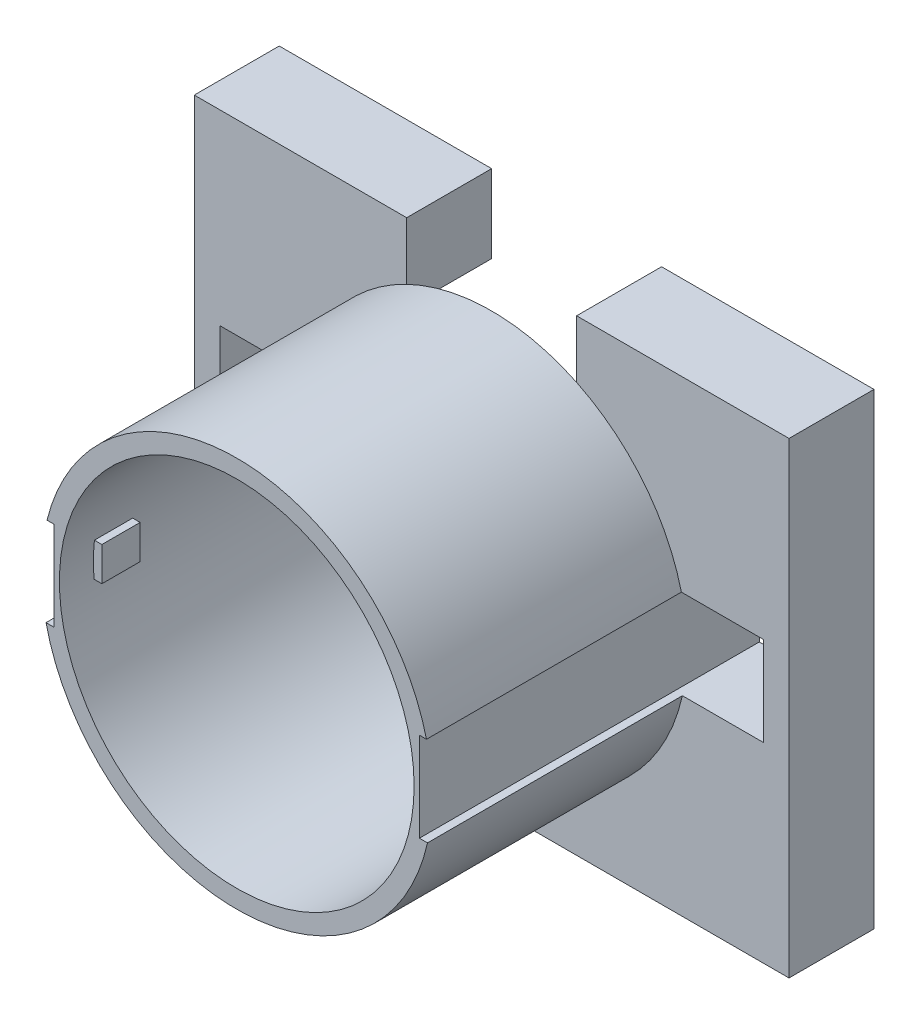
ISO-10303-21;
HEADER;
FILE_DESCRIPTION(('STEP AP214'),'2;1');
FILE_NAME('part.step','',(''),(''),'','','');
FILE_SCHEMA(('AUTOMOTIVE_DESIGN { 1 0 10303 214 1 1 1 1 }'));
ENDSEC;
DATA;
#1=APPLICATION_CONTEXT('core data for automotive mechanical design processes');
#2=APPLICATION_PROTOCOL_DEFINITION('international standard','automotive_design',2000,#1);
#3=PRODUCT_CONTEXT('',#1,'mechanical');
#4=PRODUCT('Part','Part','',(#3));
#5=PRODUCT_RELATED_PRODUCT_CATEGORY('part','',(#4));
#6=PRODUCT_DEFINITION_FORMATION('','',#4);
#7=PRODUCT_DEFINITION_CONTEXT('part definition',#1,'design');
#8=PRODUCT_DEFINITION('design','',#6,#7);
#9=PRODUCT_DEFINITION_SHAPE('','',#8);
#10=(LENGTH_UNIT() NAMED_UNIT(*) SI_UNIT(.MILLI.,.METRE.));
#11=(NAMED_UNIT(*) PLANE_ANGLE_UNIT() SI_UNIT($,.RADIAN.));
#12=(NAMED_UNIT(*) SI_UNIT($,.STERADIAN.) SOLID_ANGLE_UNIT());
#13=UNCERTAINTY_MEASURE_WITH_UNIT(LENGTH_MEASURE(1.E-05),#10,'distance_accuracy_value','');
#14=(GEOMETRIC_REPRESENTATION_CONTEXT(3) GLOBAL_UNCERTAINTY_ASSIGNED_CONTEXT((#13)) GLOBAL_UNIT_ASSIGNED_CONTEXT((#10,
#11,#12)) REPRESENTATION_CONTEXT('',''));
#15=CARTESIAN_POINT('',(0.,0.,0.));
#16=DIRECTION('',(0.,0.,1.));
#17=DIRECTION('',(1.,0.,0.));
#18=AXIS2_PLACEMENT_3D('',#15,#16,#17);
#19=CARTESIAN_POINT('',(0.,55.,20.));
#20=DIRECTION('',(0.,1.,0.));
#21=DIRECTION('',(-1.,0.,0.));
#22=AXIS2_PLACEMENT_3D('',#19,#20,#21);
#23=PLANE('',#22);
#24=DIRECTION('',(0.,0.,-1.));
#25=VECTOR('',#24,1.);
#26=CARTESIAN_POINT('',(20.,55.,20.));
#27=LINE('',#26,#25);
#28=CARTESIAN_POINT('',(20.,55.,20.));
#29=VERTEX_POINT('',#28);
#30=CARTESIAN_POINT('',(20.,55.,0.));
#31=VERTEX_POINT('',#30);
#32=EDGE_CURVE('E255',#29,#31,#27,.T.);
#33=ORIENTED_EDGE('',*,*,#32,.F.);
#34=DIRECTION('',(1.,0.,0.));
#35=VECTOR('',#34,1.);
#36=CARTESIAN_POINT('',(0.,55.,20.));
#37=LINE('',#36,#35);
#38=CARTESIAN_POINT('',(70.,55.,20.));
#39=VERTEX_POINT('',#38);
#40=EDGE_CURVE('E511',#29,#39,#37,.T.);
#41=ORIENTED_EDGE('',*,*,#40,.T.);
#42=DIRECTION('',(0.,0.,-1.));
#43=VECTOR('',#42,1.);
#44=CARTESIAN_POINT('',(70.,55.,20.));
#45=LINE('',#44,#43);
#46=CARTESIAN_POINT('',(70.,55.,0.));
#47=VERTEX_POINT('',#46);
#48=EDGE_CURVE('E297',#39,#47,#45,.T.);
#49=ORIENTED_EDGE('',*,*,#48,.T.);
#50=DIRECTION('',(1.,0.,0.));
#51=VECTOR('',#50,1.);
#52=CARTESIAN_POINT('',(0.,55.,0.));
#53=LINE('',#52,#51);
#54=EDGE_CURVE('E267',#31,#47,#53,.T.);
#55=ORIENTED_EDGE('',*,*,#54,.F.);
#56=EDGE_LOOP('',(#33,#41,#49,#55));
#57=FACE_BOUND('',#56,.T.);
#58=ADVANCED_FACE('F41',(#57),#23,.T.);
#59=CARTESIAN_POINT('',(0.,0.,20.));
#60=DIRECTION('',(0.,0.,-1.));
#61=DIRECTION('',(-1.,0.,0.));
#62=AXIS2_PLACEMENT_3D('',#59,#60,#61);
#63=CYLINDRICAL_SURFACE('',#62,41.75);
#64=DIRECTION('',(0.,0.,-1.));
#65=VECTOR('',#64,1.);
#66=CARTESIAN_POINT('',(20.,36.6478171246256,20.));
#67=LINE('',#66,#65);
#68=CARTESIAN_POINT('',(20.,36.6478171246256,20.));
#69=VERTEX_POINT('',#68);
#70=CARTESIAN_POINT('',(20.,36.6478171246256,0.));
#71=VERTEX_POINT('',#70);
#72=EDGE_CURVE('E259',#69,#71,#67,.T.);
#73=ORIENTED_EDGE('',*,*,#72,.T.);
#74=CARTESIAN_POINT('',(0.,0.,0.));
#75=DIRECTION('',(0.,0.,1.));
#76=DIRECTION('',(1.,0.,0.));
#77=AXIS2_PLACEMENT_3D('',#74,#75,#76);
#78=CIRCLE('',#77,41.75);
#79=CARTESIAN_POINT('',(-20.,36.6478171246256,0.));
#80=VERTEX_POINT('',#79);
#81=EDGE_CURVE('E250',#80,#71,#78,.T.);
#82=ORIENTED_EDGE('',*,*,#81,.F.);
#83=DIRECTION('',(0.,0.,-1.));
#84=VECTOR('',#83,1.);
#85=CARTESIAN_POINT('',(-20.,36.6478171246256,20.));
#86=LINE('',#85,#84);
#87=CARTESIAN_POINT('',(-20.,36.6478171246256,20.));
#88=VERTEX_POINT('',#87);
#89=EDGE_CURVE('E233',#80,#88,#86,.F.);
#90=ORIENTED_EDGE('',*,*,#89,.T.);
#91=CARTESIAN_POINT('',(0.,0.,20.));
#92=DIRECTION('',(0.,0.,1.));
#93=DIRECTION('',(1.,0.,0.));
#94=AXIS2_PLACEMENT_3D('',#91,#92,#93);
#95=CIRCLE('',#94,41.75);
#96=EDGE_CURVE('E542',#88,#69,#95,.F.);
#97=ORIENTED_EDGE('',*,*,#96,.T.);
#98=EDGE_LOOP('',(#73,#82,#90,#97));
#99=FACE_BOUND('',#98,.T.);
#100=CARTESIAN_POINT('',(0.,0.,80.));
#101=DIRECTION('',(0.,0.,1.));
#102=DIRECTION('',(1.,0.,0.));
#103=AXIS2_PLACEMENT_3D('',#100,#101,#102);
#104=CIRCLE('',#103,41.75);
#105=CARTESIAN_POINT('',(41.75,0.,80.));
#106=VERTEX_POINT('',#105);
#107=EDGE_CURVE('E497',#106,#106,#104,.T.);
#108=ORIENTED_EDGE('',*,*,#107,.T.);
#109=EDGE_LOOP('',(#108));
#110=FACE_BOUND('',#109,.T.);
#111=DIRECTION('',(0.,0.,-1.));
#112=VECTOR('',#111,1.);
#113=CARTESIAN_POINT('',(-41.5067765551602,4.50000000000001,20.));
#114=LINE('',#113,#112);
#115=CARTESIAN_POINT('',(-41.5067765551602,4.50000000000001,72.));
#116=VERTEX_POINT('',#115);
#117=CARTESIAN_POINT('',(-41.5067765551602,4.50000000000001,63.));
#118=VERTEX_POINT('',#117);
#119=EDGE_CURVE('E328',#116,#118,#114,.T.);
#120=ORIENTED_EDGE('',*,*,#119,.T.);
#121=CARTESIAN_POINT('',(0.,0.,63.));
#122=DIRECTION('',(0.,0.,1.));
#123=DIRECTION('',(1.,0.,0.));
#124=AXIS2_PLACEMENT_3D('',#121,#122,#123);
#125=CIRCLE('',#124,41.75);
#126=CARTESIAN_POINT('',(-41.603034745076,-3.49999999999999,63.));
#127=VERTEX_POINT('',#126);
#128=EDGE_CURVE('E317',#118,#127,#125,.T.);
#129=ORIENTED_EDGE('',*,*,#128,.T.);
#130=DIRECTION('',(0.,0.,-1.));
#131=VECTOR('',#130,1.);
#132=CARTESIAN_POINT('',(-41.603034745076,-3.49999999999999,20.));
#133=LINE('',#132,#131);
#134=CARTESIAN_POINT('',(-41.603034745076,-3.49999999999999,72.));
#135=VERTEX_POINT('',#134);
#136=EDGE_CURVE('E321',#127,#135,#133,.F.);
#137=ORIENTED_EDGE('',*,*,#136,.T.);
#138=CARTESIAN_POINT('',(0.,0.,72.));
#139=DIRECTION('',(0.,0.,-1.));
#140=DIRECTION('',(-1.,0.,0.));
#141=AXIS2_PLACEMENT_3D('',#138,#139,#140);
#142=CIRCLE('',#141,41.75);
#143=EDGE_CURVE('E325',#135,#116,#142,.T.);
#144=ORIENTED_EDGE('',*,*,#143,.T.);
#145=EDGE_LOOP('',(#120,#129,#137,#144));
#146=FACE_BOUND('',#145,.T.);
#147=DIRECTION('',(0.,0.,-1.));
#148=VECTOR('',#147,1.);
#149=CARTESIAN_POINT('',(41.5067765551602,4.5,20.));
#150=LINE('',#149,#148);
#151=CARTESIAN_POINT('',(41.5067765551602,4.5,63.));
#152=VERTEX_POINT('',#151);
#153=CARTESIAN_POINT('',(41.5067765551602,4.5,72.));
#154=VERTEX_POINT('',#153);
#155=EDGE_CURVE('E11',#152,#154,#150,.F.);
#156=ORIENTED_EDGE('',*,*,#155,.T.);
#157=CARTESIAN_POINT('',(0.,0.,72.));
#158=DIRECTION('',(0.,0.,-1.));
#159=DIRECTION('',(-1.,0.,0.));
#160=AXIS2_PLACEMENT_3D('',#157,#158,#159);
#161=CIRCLE('',#160,41.75);
#162=CARTESIAN_POINT('',(41.603034745076,-3.5,72.));
#163=VERTEX_POINT('',#162);
#164=EDGE_CURVE('E335',#154,#163,#161,.T.);
#165=ORIENTED_EDGE('',*,*,#164,.T.);
#166=DIRECTION('',(0.,0.,-1.));
#167=VECTOR('',#166,1.);
#168=CARTESIAN_POINT('',(41.603034745076,-3.50000000000001,20.));
#169=LINE('',#168,#167);
#170=CARTESIAN_POINT('',(41.603034745076,-3.5,63.));
#171=VERTEX_POINT('',#170);
#172=EDGE_CURVE('E50',#163,#171,#169,.T.);
#173=ORIENTED_EDGE('',*,*,#172,.T.);
#174=CARTESIAN_POINT('',(0.,0.,63.));
#175=DIRECTION('',(0.,0.,1.));
#176=DIRECTION('',(1.,0.,0.));
#177=AXIS2_PLACEMENT_3D('',#174,#175,#176);
#178=CIRCLE('',#177,41.75);
#179=EDGE_CURVE('E332',#171,#152,#178,.T.);
#180=ORIENTED_EDGE('',*,*,#179,.T.);
#181=EDGE_LOOP('',(#156,#165,#173,#180));
#182=FACE_BOUND('',#181,.T.);
#183=ADVANCED_FACE('F43',(#99,#110,#146,#182),#63,.F.);
#184=CARTESIAN_POINT('',(0.,0.,80.));
#185=DIRECTION('',(0.,0.,-1.));
#186=DIRECTION('',(-1.,0.,0.));
#187=AXIS2_PLACEMENT_3D('',#184,#185,#186);
#188=CYLINDRICAL_SURFACE('',#187,46.);
#189=CARTESIAN_POINT('',(0.,0.,80.));
#190=DIRECTION('',(0.,0.,1.));
#191=DIRECTION('',(1.,0.,0.));
#192=AXIS2_PLACEMENT_3D('',#189,#190,#191);
#193=CIRCLE('',#192,46.);
#194=CARTESIAN_POINT('',(-44.8998886412873,-9.99999999999999,80.));
#195=VERTEX_POINT('',#194);
#196=CARTESIAN_POINT('',(44.8998886412873,-9.99999999999999,80.));
#197=VERTEX_POINT('',#196);
#198=EDGE_CURVE('E270',#195,#197,#193,.T.);
#199=ORIENTED_EDGE('',*,*,#198,.F.);
#200=DIRECTION('',(0.,0.,-1.));
#201=VECTOR('',#200,1.);
#202=CARTESIAN_POINT('',(-44.8998886412873,-9.99999999999999,80.));
#203=LINE('',#202,#201);
#204=CARTESIAN_POINT('',(-44.8998886412873,-9.99999999999999,20.));
#205=VERTEX_POINT('',#204);
#206=EDGE_CURVE('E313',#195,#205,#203,.T.);
#207=ORIENTED_EDGE('',*,*,#206,.T.);
#208=CARTESIAN_POINT('',(0.,0.,20.));
#209=DIRECTION('',(0.,0.,1.));
#210=DIRECTION('',(1.,0.,0.));
#211=AXIS2_PLACEMENT_3D('',#208,#209,#210);
#212=CIRCLE('',#211,46.);
#213=CARTESIAN_POINT('',(44.8998886412873,-9.99999999999999,20.));
#214=VERTEX_POINT('',#213);
#215=EDGE_CURVE('E500',#205,#214,#212,.T.);
#216=ORIENTED_EDGE('',*,*,#215,.T.);
#217=DIRECTION('',(0.,0.,-1.));
#218=VECTOR('',#217,1.);
#219=CARTESIAN_POINT('',(44.8998886412873,-9.99999999999999,80.));
#220=LINE('',#219,#218);
#221=EDGE_CURVE('E301',#214,#197,#220,.F.);
#222=ORIENTED_EDGE('',*,*,#221,.T.);
#223=EDGE_LOOP('',(#199,#207,#216,#222));
#224=FACE_BOUND('',#223,.T.);
#225=ADVANCED_FACE('F580',(#224),#188,.T.);
#226=CARTESIAN_POINT('',(0.,0.,20.));
#227=DIRECTION('',(0.,0.,1.));
#228=DIRECTION('',(1.,0.,0.));
#229=AXIS2_PLACEMENT_3D('',#226,#227,#228);
#230=PLANE('',#229);
#231=DIRECTION('',(0.,1.,0.));
#232=VECTOR('',#231,1.);
#233=CARTESIAN_POINT('',(20.,-55.001,20.));
#234=LINE('',#233,#232);
#235=CARTESIAN_POINT('',(20.,41.424630354416,20.));
#236=VERTEX_POINT('',#235);
#237=EDGE_CURVE('E546',#236,#29,#234,.T.);
#238=ORIENTED_EDGE('',*,*,#237,.F.);
#239=CARTESIAN_POINT('',(44.6654228682546,11.,20.));
#240=VERTEX_POINT('',#239);
#241=EDGE_CURVE('E502',#240,#236,#212,.T.);
#242=ORIENTED_EDGE('',*,*,#241,.F.);
#243=DIRECTION('',(-1.,0.,0.));
#244=VECTOR('',#243,1.);
#245=CARTESIAN_POINT('',(0.,11.,20.));
#246=LINE('',#245,#244);
#247=CARTESIAN_POINT('',(64.,11.,20.));
#248=VERTEX_POINT('',#247);
#249=EDGE_CURVE('E482',#248,#240,#246,.T.);
#250=ORIENTED_EDGE('',*,*,#249,.F.);
#251=DIRECTION('',(0.,1.,0.));
#252=VECTOR('',#251,1.);
#253=CARTESIAN_POINT('',(64.,0.,20.));
#254=LINE('',#253,#252);
#255=CARTESIAN_POINT('',(64.,-9.99999999999999,20.));
#256=VERTEX_POINT('',#255);
#257=EDGE_CURVE('E491',#256,#248,#254,.T.);
#258=ORIENTED_EDGE('',*,*,#257,.F.);
#259=DIRECTION('',(1.,0.,0.));
#260=VECTOR('',#259,1.);
#261=CARTESIAN_POINT('',(0.,-9.99999999999999,20.));
#262=LINE('',#261,#260);
#263=EDGE_CURVE('E432',#214,#256,#262,.T.);
#264=ORIENTED_EDGE('',*,*,#263,.F.);
#265=ORIENTED_EDGE('',*,*,#215,.F.);
#266=DIRECTION('',(1.,0.,0.));
#267=VECTOR('',#266,1.);
#268=CARTESIAN_POINT('',(0.,-9.99999999999999,20.));
#269=LINE('',#268,#267);
#270=CARTESIAN_POINT('',(-64.,-9.99999999999999,20.));
#271=VERTEX_POINT('',#270);
#272=EDGE_CURVE('E488',#271,#205,#269,.T.);
#273=ORIENTED_EDGE('',*,*,#272,.F.);
#274=DIRECTION('',(0.,-1.,0.));
#275=VECTOR('',#274,1.);
#276=CARTESIAN_POINT('',(-64.,0.,20.));
#277=LINE('',#276,#275);
#278=CARTESIAN_POINT('',(-64.,11.,20.));
#279=VERTEX_POINT('',#278);
#280=EDGE_CURVE('E494',#279,#271,#277,.T.);
#281=ORIENTED_EDGE('',*,*,#280,.F.);
#282=DIRECTION('',(-1.,0.,0.));
#283=VECTOR('',#282,1.);
#284=CARTESIAN_POINT('',(0.,11.,20.));
#285=LINE('',#284,#283);
#286=CARTESIAN_POINT('',(-44.6654228682546,11.,20.));
#287=VERTEX_POINT('',#286);
#288=EDGE_CURVE('E485',#287,#279,#285,.T.);
#289=ORIENTED_EDGE('',*,*,#288,.F.);
#290=CARTESIAN_POINT('',(-20.,41.424630354416,20.));
#291=VERTEX_POINT('',#290);
#292=EDGE_CURVE('E507',#291,#287,#212,.T.);
#293=ORIENTED_EDGE('',*,*,#292,.F.);
#294=DIRECTION('',(0.,1.,0.));
#295=VECTOR('',#294,1.);
#296=CARTESIAN_POINT('',(-20.,-55.001,20.));
#297=LINE('',#296,#295);
#298=CARTESIAN_POINT('',(-20.,55.,20.));
#299=VERTEX_POINT('',#298);
#300=EDGE_CURVE('E242',#291,#299,#297,.T.);
#301=ORIENTED_EDGE('',*,*,#300,.T.);
#302=CARTESIAN_POINT('',(-70.,55.,20.));
#303=VERTEX_POINT('',#302);
#304=EDGE_CURVE('E512',#303,#299,#37,.T.);
#305=ORIENTED_EDGE('',*,*,#304,.F.);
#306=DIRECTION('',(0.,-1.,0.));
#307=VECTOR('',#306,1.);
#308=CARTESIAN_POINT('',(-70.,0.,20.));
#309=LINE('',#308,#307);
#310=CARTESIAN_POINT('',(-70.,-55.,20.));
#311=VERTEX_POINT('',#310);
#312=EDGE_CURVE('E515',#303,#311,#309,.T.);
#313=ORIENTED_EDGE('',*,*,#312,.T.);
#314=DIRECTION('',(1.,0.,0.));
#315=VECTOR('',#314,1.);
#316=CARTESIAN_POINT('',(0.,-55.,20.));
#317=LINE('',#316,#315);
#318=CARTESIAN_POINT('',(70.,-55.,20.));
#319=VERTEX_POINT('',#318);
#320=EDGE_CURVE('E273',#311,#319,#317,.T.);
#321=ORIENTED_EDGE('',*,*,#320,.T.);
#322=DIRECTION('',(0.,-1.,0.));
#323=VECTOR('',#322,1.);
#324=CARTESIAN_POINT('',(70.,0.,20.));
#325=LINE('',#324,#323);
#326=EDGE_CURVE('E286',#39,#319,#325,.T.);
#327=ORIENTED_EDGE('',*,*,#326,.F.);
#328=ORIENTED_EDGE('',*,*,#40,.F.);
#329=EDGE_LOOP('',(#238,#242,#250,#258,#264,#265,#273,#281,#289,#293,#301,#305,#313,#321,#327,#328));
#330=FACE_BOUND('',#329,.T.);
#331=ADVANCED_FACE('F526',(#330),#230,.T.);
#332=CARTESIAN_POINT('',(70.,0.,20.));
#333=DIRECTION('',(1.,0.,0.));
#334=DIRECTION('',(0.,0.,-1.));
#335=AXIS2_PLACEMENT_3D('',#332,#333,#334);
#336=PLANE('',#335);
#337=DIRECTION('',(0.,-1.,0.));
#338=VECTOR('',#337,1.);
#339=CARTESIAN_POINT('',(70.,0.,0.));
#340=LINE('',#339,#338);
#341=CARTESIAN_POINT('',(70.,-55.,0.));
#342=VERTEX_POINT('',#341);
#343=EDGE_CURVE('E261',#47,#342,#340,.T.);
#344=ORIENTED_EDGE('',*,*,#343,.F.);
#345=ORIENTED_EDGE('',*,*,#48,.F.);
#346=ORIENTED_EDGE('',*,*,#326,.T.);
#347=DIRECTION('',(0.,0.,-1.));
#348=VECTOR('',#347,1.);
#349=CARTESIAN_POINT('',(70.,-55.,20.));
#350=LINE('',#349,#348);
#351=EDGE_CURVE('E287',#319,#342,#350,.T.);
#352=ORIENTED_EDGE('',*,*,#351,.T.);
#353=EDGE_LOOP('',(#344,#345,#346,#352));
#354=FACE_BOUND('',#353,.T.);
#355=ADVANCED_FACE('F533',(#354),#336,.T.);
#356=DIRECTION('',(0.,0.,1.));
#357=VECTOR('',#356,1.);
#358=CARTESIAN_POINT('',(-20.,55.,20.));
#359=LINE('',#358,#357);
#360=CARTESIAN_POINT('',(-20.,55.,0.));
#361=VERTEX_POINT('',#360);
#362=EDGE_CURVE('E554',#361,#299,#359,.T.);
#363=ORIENTED_EDGE('',*,*,#362,.F.);
#364=CARTESIAN_POINT('',(-70.,55.,0.));
#365=VERTEX_POINT('',#364);
#366=EDGE_CURVE('E253',#365,#361,#53,.T.);
#367=ORIENTED_EDGE('',*,*,#366,.F.);
#368=DIRECTION('',(0.,0.,-1.));
#369=VECTOR('',#368,1.);
#370=CARTESIAN_POINT('',(-70.,55.,20.));
#371=LINE('',#370,#369);
#372=EDGE_CURVE('E294',#303,#365,#371,.T.);
#373=ORIENTED_EDGE('',*,*,#372,.F.);
#374=ORIENTED_EDGE('',*,*,#304,.T.);
#375=EDGE_LOOP('',(#363,#367,#373,#374));
#376=FACE_BOUND('',#375,.T.);
#377=ADVANCED_FACE('F576',(#376),#23,.T.);
#378=CARTESIAN_POINT('',(-70.,0.,20.));
#379=DIRECTION('',(1.,0.,0.));
#380=DIRECTION('',(0.,1.,0.));
#381=AXIS2_PLACEMENT_3D('',#378,#379,#380);
#382=PLANE('',#381);
#383=DIRECTION('',(0.,-1.,0.));
#384=VECTOR('',#383,1.);
#385=CARTESIAN_POINT('',(-70.,0.,0.));
#386=LINE('',#385,#384);
#387=CARTESIAN_POINT('',(-70.,-55.,0.));
#388=VERTEX_POINT('',#387);
#389=EDGE_CURVE('E278',#365,#388,#386,.T.);
#390=ORIENTED_EDGE('',*,*,#389,.T.);
#391=DIRECTION('',(0.,0.,-1.));
#392=VECTOR('',#391,1.);
#393=CARTESIAN_POINT('',(-70.,-55.,20.));
#394=LINE('',#393,#392);
#395=EDGE_CURVE('E290',#311,#388,#394,.T.);
#396=ORIENTED_EDGE('',*,*,#395,.F.);
#397=ORIENTED_EDGE('',*,*,#312,.F.);
#398=ORIENTED_EDGE('',*,*,#372,.T.);
#399=EDGE_LOOP('',(#390,#396,#397,#398));
#400=FACE_BOUND('',#399,.T.);
#401=ADVANCED_FACE('F583',(#400),#382,.F.);
#402=CARTESIAN_POINT('',(0.,-55.,20.));
#403=DIRECTION('',(0.,1.,0.));
#404=DIRECTION('',(0.,0.,1.));
#405=AXIS2_PLACEMENT_3D('',#402,#403,#404);
#406=PLANE('',#405);
#407=DIRECTION('',(1.,0.,0.));
#408=VECTOR('',#407,1.);
#409=CARTESIAN_POINT('',(0.,-55.,0.));
#410=LINE('',#409,#408);
#411=EDGE_CURVE('E282',#388,#342,#410,.T.);
#412=ORIENTED_EDGE('',*,*,#411,.T.);
#413=ORIENTED_EDGE('',*,*,#351,.F.);
#414=ORIENTED_EDGE('',*,*,#320,.F.);
#415=ORIENTED_EDGE('',*,*,#395,.T.);
#416=EDGE_LOOP('',(#412,#413,#414,#415));
#417=FACE_BOUND('',#416,.T.);
#418=ADVANCED_FACE('F529',(#417),#406,.F.);
#419=CARTESIAN_POINT('',(0.,0.,0.));
#420=DIRECTION('',(0.,0.,1.));
#421=DIRECTION('',(1.,0.,0.));
#422=AXIS2_PLACEMENT_3D('',#419,#420,#421);
#423=PLANE('',#422);
#424=DIRECTION('',(1.,0.,0.));
#425=VECTOR('',#424,1.);
#426=CARTESIAN_POINT('',(-64.,11.,0.));
#427=LINE('',#426,#425);
#428=CARTESIAN_POINT('',(-64.,11.,0.));
#429=VERTEX_POINT('',#428);
#430=CARTESIAN_POINT('',(-43.,11.,0.));
#431=VERTEX_POINT('',#430);
#432=EDGE_CURVE('E417',#429,#431,#427,.T.);
#433=ORIENTED_EDGE('',*,*,#432,.F.);
#434=DIRECTION('',(0.,1.,0.));
#435=VECTOR('',#434,1.);
#436=CARTESIAN_POINT('',(-64.,-9.99999999999999,0.));
#437=LINE('',#436,#435);
#438=CARTESIAN_POINT('',(-64.,-9.99999999999999,0.));
#439=VERTEX_POINT('',#438);
#440=EDGE_CURVE('E414',#439,#429,#437,.T.);
#441=ORIENTED_EDGE('',*,*,#440,.F.);
#442=DIRECTION('',(-1.,0.,0.));
#443=VECTOR('',#442,1.);
#444=CARTESIAN_POINT('',(-64.,-9.99999999999999,0.));
#445=LINE('',#444,#443);
#446=CARTESIAN_POINT('',(-43.,-9.99999999999999,0.));
#447=VERTEX_POINT('',#446);
#448=EDGE_CURVE('E405',#447,#439,#445,.T.);
#449=ORIENTED_EDGE('',*,*,#448,.F.);
#450=DIRECTION('',(0.,-1.,0.));
#451=VECTOR('',#450,1.);
#452=CARTESIAN_POINT('',(-43.,-9.99999999999999,0.));
#453=LINE('',#452,#451);
#454=EDGE_CURVE('E422',#431,#447,#453,.T.);
#455=ORIENTED_EDGE('',*,*,#454,.F.);
#456=EDGE_LOOP('',(#433,#441,#449,#455));
#457=FACE_BOUND('',#456,.T.);
#458=DIRECTION('',(-1.,0.,0.));
#459=VECTOR('',#458,1.);
#460=CARTESIAN_POINT('',(64.,-9.99999999999999,0.));
#461=LINE('',#460,#459);
#462=CARTESIAN_POINT('',(64.,-9.99999999999999,0.));
#463=VERTEX_POINT('',#462);
#464=CARTESIAN_POINT('',(43.,-9.99999999999999,0.));
#465=VERTEX_POINT('',#464);
#466=EDGE_CURVE('E458',#463,#465,#461,.T.);
#467=ORIENTED_EDGE('',*,*,#466,.F.);
#468=DIRECTION('',(0.,-1.,0.));
#469=VECTOR('',#468,1.);
#470=CARTESIAN_POINT('',(64.,-9.99999999999999,0.));
#471=LINE('',#470,#469);
#472=CARTESIAN_POINT('',(64.,11.,0.));
#473=VERTEX_POINT('',#472);
#474=EDGE_CURVE('E399',#473,#463,#471,.T.);
#475=ORIENTED_EDGE('',*,*,#474,.F.);
#476=DIRECTION('',(1.,0.,0.));
#477=VECTOR('',#476,1.);
#478=CARTESIAN_POINT('',(64.,11.,0.));
#479=LINE('',#478,#477);
#480=CARTESIAN_POINT('',(43.,11.,0.));
#481=VERTEX_POINT('',#480);
#482=EDGE_CURVE('E447',#481,#473,#479,.T.);
#483=ORIENTED_EDGE('',*,*,#482,.F.);
#484=DIRECTION('',(0.,1.,0.));
#485=VECTOR('',#484,1.);
#486=CARTESIAN_POINT('',(43.,-9.99999999999999,0.));
#487=LINE('',#486,#485);
#488=EDGE_CURVE('E462',#465,#481,#487,.T.);
#489=ORIENTED_EDGE('',*,*,#488,.F.);
#490=EDGE_LOOP('',(#467,#475,#483,#489));
#491=FACE_BOUND('',#490,.T.);
#492=ORIENTED_EDGE('',*,*,#81,.T.);
#493=DIRECTION('',(0.,1.,0.));
#494=VECTOR('',#493,1.);
#495=CARTESIAN_POINT('',(20.,-55.001,0.));
#496=LINE('',#495,#494);
#497=EDGE_CURVE('E539',#71,#31,#496,.T.);
#498=ORIENTED_EDGE('',*,*,#497,.T.);
#499=ORIENTED_EDGE('',*,*,#54,.T.);
#500=ORIENTED_EDGE('',*,*,#343,.T.);
#501=ORIENTED_EDGE('',*,*,#411,.F.);
#502=ORIENTED_EDGE('',*,*,#389,.F.);
#503=ORIENTED_EDGE('',*,*,#366,.T.);
#504=DIRECTION('',(0.,1.,0.));
#505=VECTOR('',#504,1.);
#506=CARTESIAN_POINT('',(-20.,-55.001,0.));
#507=LINE('',#506,#505);
#508=EDGE_CURVE('E236',#80,#361,#507,.T.);
#509=ORIENTED_EDGE('',*,*,#508,.F.);
#510=EDGE_LOOP('',(#492,#498,#499,#500,#501,#502,#503,#509));
#511=FACE_BOUND('',#510,.T.);
#512=ADVANCED_FACE('F248',(#457,#491,#511),#423,.F.);
#513=CARTESIAN_POINT('',(0.,0.,80.));
#514=DIRECTION('',(0.,0.,1.));
#515=DIRECTION('',(1.,0.,0.));
#516=AXIS2_PLACEMENT_3D('',#513,#514,#515);
#517=PLANE('',#516);
#518=DIRECTION('',(-1.,0.,0.));
#519=VECTOR('',#518,1.);
#520=CARTESIAN_POINT('',(-64.,-9.99999999999999,80.));
#521=LINE('',#520,#519);
#522=CARTESIAN_POINT('',(-43.,-9.99999999999999,80.));
#523=VERTEX_POINT('',#522);
#524=EDGE_CURVE('E409',#523,#195,#521,.T.);
#525=ORIENTED_EDGE('',*,*,#524,.T.);
#526=ORIENTED_EDGE('',*,*,#198,.T.);
#527=DIRECTION('',(-1.,0.,0.));
#528=VECTOR('',#527,1.);
#529=CARTESIAN_POINT('',(64.,-9.99999999999999,80.));
#530=LINE('',#529,#528);
#531=CARTESIAN_POINT('',(43.,-9.99999999999999,80.));
#532=VERTEX_POINT('',#531);
#533=EDGE_CURVE('E442',#197,#532,#530,.T.);
#534=ORIENTED_EDGE('',*,*,#533,.T.);
#535=DIRECTION('',(0.,1.,0.));
#536=VECTOR('',#535,1.);
#537=CARTESIAN_POINT('',(43.,-9.99999999999999,80.));
#538=LINE('',#537,#536);
#539=CARTESIAN_POINT('',(43.,11.,80.));
#540=VERTEX_POINT('',#539);
#541=EDGE_CURVE('E446',#532,#540,#538,.T.);
#542=ORIENTED_EDGE('',*,*,#541,.T.);
#543=DIRECTION('',(1.,0.,0.));
#544=VECTOR('',#543,1.);
#545=CARTESIAN_POINT('',(64.,11.,80.));
#546=LINE('',#545,#544);
#547=CARTESIAN_POINT('',(44.6654228682546,11.,80.));
#548=VERTEX_POINT('',#547);
#549=EDGE_CURVE('E451',#540,#548,#546,.T.);
#550=ORIENTED_EDGE('',*,*,#549,.T.);
#551=CARTESIAN_POINT('',(-44.6654228682546,11.,80.));
#552=VERTEX_POINT('',#551);
#553=EDGE_CURVE('E262',#548,#552,#193,.T.);
#554=ORIENTED_EDGE('',*,*,#553,.T.);
#555=DIRECTION('',(1.,0.,0.));
#556=VECTOR('',#555,1.);
#557=CARTESIAN_POINT('',(-64.,11.,80.));
#558=LINE('',#557,#556);
#559=CARTESIAN_POINT('',(-43.,11.,80.));
#560=VERTEX_POINT('',#559);
#561=EDGE_CURVE('E400',#552,#560,#558,.T.);
#562=ORIENTED_EDGE('',*,*,#561,.T.);
#563=DIRECTION('',(0.,-1.,0.));
#564=VECTOR('',#563,1.);
#565=CARTESIAN_POINT('',(-43.,-9.99999999999999,80.));
#566=LINE('',#565,#564);
#567=EDGE_CURVE('E404',#560,#523,#566,.T.);
#568=ORIENTED_EDGE('',*,*,#567,.T.);
#569=EDGE_LOOP('',(#525,#526,#534,#542,#550,#554,#562,#568));
#570=FACE_BOUND('',#569,.T.);
#571=ORIENTED_EDGE('',*,*,#107,.F.);
#572=EDGE_LOOP('',(#571));
#573=FACE_BOUND('',#572,.T.);
#574=ADVANCED_FACE('F637',(#570,#573),#517,.T.);
#575=ORIENTED_EDGE('',*,*,#241,.T.);
#576=EDGE_CURVE('E506',#236,#291,#212,.T.);
#577=ORIENTED_EDGE('',*,*,#576,.T.);
#578=ORIENTED_EDGE('',*,*,#292,.T.);
#579=DIRECTION('',(0.,0.,-1.));
#580=VECTOR('',#579,1.);
#581=CARTESIAN_POINT('',(-44.6654228682546,11.,80.));
#582=LINE('',#581,#580);
#583=EDGE_CURVE('E309',#287,#552,#582,.F.);
#584=ORIENTED_EDGE('',*,*,#583,.T.);
#585=ORIENTED_EDGE('',*,*,#553,.F.);
#586=DIRECTION('',(0.,0.,-1.));
#587=VECTOR('',#586,1.);
#588=CARTESIAN_POINT('',(44.6654228682546,11.,80.));
#589=LINE('',#588,#587);
#590=EDGE_CURVE('E305',#548,#240,#589,.T.);
#591=ORIENTED_EDGE('',*,*,#590,.T.);
#592=EDGE_LOOP('',(#575,#577,#578,#584,#585,#591));
#593=FACE_BOUND('',#592,.T.);
#594=ADVANCED_FACE('F607',(#593),#188,.T.);
#595=CARTESIAN_POINT('',(64.,-9.99999999999999,80.));
#596=DIRECTION('',(1.,0.,0.));
#597=DIRECTION('',(0.,0.,-1.));
#598=AXIS2_PLACEMENT_3D('',#595,#596,#597);
#599=PLANE('',#598);
#600=ORIENTED_EDGE('',*,*,#257,.T.);
#601=DIRECTION('',(0.,0.,-1.));
#602=VECTOR('',#601,1.);
#603=CARTESIAN_POINT('',(64.,11.,80.));
#604=LINE('',#603,#602);
#605=EDGE_CURVE('E418',#248,#473,#604,.T.);
#606=ORIENTED_EDGE('',*,*,#605,.T.);
#607=ORIENTED_EDGE('',*,*,#474,.T.);
#608=DIRECTION('',(0.,0.,-1.));
#609=VECTOR('',#608,1.);
#610=CARTESIAN_POINT('',(64.,-9.99999999999999,80.));
#611=LINE('',#610,#609);
#612=EDGE_CURVE('E455',#256,#463,#611,.T.);
#613=ORIENTED_EDGE('',*,*,#612,.F.);
#614=EDGE_LOOP('',(#600,#606,#607,#613));
#615=FACE_BOUND('',#614,.T.);
#616=ADVANCED_FACE('F626',(#615),#599,.F.);
#617=CARTESIAN_POINT('',(64.,11.,80.));
#618=DIRECTION('',(0.,1.,0.));
#619=DIRECTION('',(0.,0.,1.));
#620=AXIS2_PLACEMENT_3D('',#617,#618,#619);
#621=PLANE('',#620);
#622=ORIENTED_EDGE('',*,*,#249,.T.);
#623=ORIENTED_EDGE('',*,*,#590,.F.);
#624=ORIENTED_EDGE('',*,*,#549,.F.);
#625=DIRECTION('',(0.,0.,-1.));
#626=VECTOR('',#625,1.);
#627=CARTESIAN_POINT('',(43.,11.,80.));
#628=LINE('',#627,#626);
#629=EDGE_CURVE('E471',#540,#481,#628,.T.);
#630=ORIENTED_EDGE('',*,*,#629,.T.);
#631=ORIENTED_EDGE('',*,*,#482,.T.);
#632=ORIENTED_EDGE('',*,*,#605,.F.);
#633=EDGE_LOOP('',(#622,#623,#624,#630,#631,#632));
#634=FACE_BOUND('',#633,.T.);
#635=ADVANCED_FACE('F659',(#634),#621,.F.);
#636=CARTESIAN_POINT('',(43.,-9.99999999999999,80.));
#637=DIRECTION('',(-1.,0.,0.));
#638=DIRECTION('',(0.,0.,1.));
#639=AXIS2_PLACEMENT_3D('',#636,#637,#638);
#640=PLANE('',#639);
#641=ORIENTED_EDGE('',*,*,#488,.T.);
#642=ORIENTED_EDGE('',*,*,#629,.F.);
#643=ORIENTED_EDGE('',*,*,#541,.F.);
#644=DIRECTION('',(0.,0.,-1.));
#645=VECTOR('',#644,1.);
#646=CARTESIAN_POINT('',(43.,-9.99999999999999,80.));
#647=LINE('',#646,#645);
#648=EDGE_CURVE('E474',#532,#465,#647,.T.);
#649=ORIENTED_EDGE('',*,*,#648,.T.);
#650=EDGE_LOOP('',(#641,#642,#643,#649));
#651=FACE_BOUND('',#650,.T.);
#652=ADVANCED_FACE('F634',(#651),#640,.F.);
#653=CARTESIAN_POINT('',(64.,-9.99999999999999,80.));
#654=DIRECTION('',(0.,-1.,0.));
#655=DIRECTION('',(0.,0.,-1.));
#656=AXIS2_PLACEMENT_3D('',#653,#654,#655);
#657=PLANE('',#656);
#658=ORIENTED_EDGE('',*,*,#263,.T.);
#659=ORIENTED_EDGE('',*,*,#612,.T.);
#660=ORIENTED_EDGE('',*,*,#466,.T.);
#661=ORIENTED_EDGE('',*,*,#648,.F.);
#662=ORIENTED_EDGE('',*,*,#533,.F.);
#663=ORIENTED_EDGE('',*,*,#221,.F.);
#664=EDGE_LOOP('',(#658,#659,#660,#661,#662,#663));
#665=FACE_BOUND('',#664,.T.);
#666=ADVANCED_FACE('F623',(#665),#657,.F.);
#667=CARTESIAN_POINT('',(-64.,-9.99999999999999,80.));
#668=DIRECTION('',(-1.,0.,0.));
#669=DIRECTION('',(0.,0.,1.));
#670=AXIS2_PLACEMENT_3D('',#667,#668,#669);
#671=PLANE('',#670);
#672=ORIENTED_EDGE('',*,*,#280,.T.);
#673=DIRECTION('',(0.,0.,-1.));
#674=VECTOR('',#673,1.);
#675=CARTESIAN_POINT('',(-64.,-9.99999999999999,80.));
#676=LINE('',#675,#674);
#677=EDGE_CURVE('E429',#271,#439,#676,.T.);
#678=ORIENTED_EDGE('',*,*,#677,.T.);
#679=ORIENTED_EDGE('',*,*,#440,.T.);
#680=DIRECTION('',(0.,0.,-1.));
#681=VECTOR('',#680,1.);
#682=CARTESIAN_POINT('',(-64.,11.,80.));
#683=LINE('',#682,#681);
#684=EDGE_CURVE('E413',#279,#429,#683,.T.);
#685=ORIENTED_EDGE('',*,*,#684,.F.);
#686=EDGE_LOOP('',(#672,#678,#679,#685));
#687=FACE_BOUND('',#686,.T.);
#688=ADVANCED_FACE('F648',(#687),#671,.F.);
#689=CARTESIAN_POINT('',(-64.,-9.99999999999999,80.));
#690=DIRECTION('',(0.,-1.,0.));
#691=DIRECTION('',(0.,0.,-1.));
#692=AXIS2_PLACEMENT_3D('',#689,#690,#691);
#693=PLANE('',#692);
#694=ORIENTED_EDGE('',*,*,#272,.T.);
#695=ORIENTED_EDGE('',*,*,#206,.F.);
#696=ORIENTED_EDGE('',*,*,#524,.F.);
#697=DIRECTION('',(0.,0.,-1.));
#698=VECTOR('',#697,1.);
#699=CARTESIAN_POINT('',(-43.,-9.99999999999999,80.));
#700=LINE('',#699,#698);
#701=EDGE_CURVE('E433',#523,#447,#700,.T.);
#702=ORIENTED_EDGE('',*,*,#701,.T.);
#703=ORIENTED_EDGE('',*,*,#448,.T.);
#704=ORIENTED_EDGE('',*,*,#677,.F.);
#705=EDGE_LOOP('',(#694,#695,#696,#702,#703,#704));
#706=FACE_BOUND('',#705,.T.);
#707=ADVANCED_FACE('F643',(#706),#693,.F.);
#708=CARTESIAN_POINT('',(-43.,-9.99999999999999,80.));
#709=DIRECTION('',(1.,0.,0.));
#710=DIRECTION('',(0.,0.,-1.));
#711=AXIS2_PLACEMENT_3D('',#708,#709,#710);
#712=PLANE('',#711);
#713=ORIENTED_EDGE('',*,*,#454,.T.);
#714=ORIENTED_EDGE('',*,*,#701,.F.);
#715=ORIENTED_EDGE('',*,*,#567,.F.);
#716=DIRECTION('',(0.,0.,-1.));
#717=VECTOR('',#716,1.);
#718=CARTESIAN_POINT('',(-43.,11.,80.));
#719=LINE('',#718,#717);
#720=EDGE_CURVE('E436',#560,#431,#719,.T.);
#721=ORIENTED_EDGE('',*,*,#720,.T.);
#722=EDGE_LOOP('',(#713,#714,#715,#721));
#723=FACE_BOUND('',#722,.T.);
#724=ADVANCED_FACE('F656',(#723),#712,.F.);
#725=CARTESIAN_POINT('',(-64.,11.,80.));
#726=DIRECTION('',(0.,1.,0.));
#727=DIRECTION('',(-1.,0.,0.));
#728=AXIS2_PLACEMENT_3D('',#725,#726,#727);
#729=PLANE('',#728);
#730=ORIENTED_EDGE('',*,*,#288,.T.);
#731=ORIENTED_EDGE('',*,*,#684,.T.);
#732=ORIENTED_EDGE('',*,*,#432,.T.);
#733=ORIENTED_EDGE('',*,*,#720,.F.);
#734=ORIENTED_EDGE('',*,*,#561,.F.);
#735=ORIENTED_EDGE('',*,*,#583,.F.);
#736=EDGE_LOOP('',(#730,#731,#732,#733,#734,#735));
#737=FACE_BOUND('',#736,.T.);
#738=ADVANCED_FACE('F652',(#737),#729,.F.);
#739=CARTESIAN_POINT('',(-39.75,-3.49999999999999,72.));
#740=DIRECTION('',(0.,0.,-1.));
#741=DIRECTION('',(-1.,0.,0.));
#742=AXIS2_PLACEMENT_3D('',#739,#740,#741);
#743=PLANE('',#742);
#744=DIRECTION('',(-1.,0.,0.));
#745=VECTOR('',#744,1.);
#746=CARTESIAN_POINT('',(-39.75,4.50000000000001,72.));
#747=LINE('',#746,#745);
#748=CARTESIAN_POINT('',(-39.75,4.50000000000001,72.));
#749=VERTEX_POINT('',#748);
#750=EDGE_CURVE('E383',#749,#116,#747,.T.);
#751=ORIENTED_EDGE('',*,*,#750,.T.);
#752=ORIENTED_EDGE('',*,*,#143,.F.);
#753=DIRECTION('',(-1.,0.,0.));
#754=VECTOR('',#753,1.);
#755=CARTESIAN_POINT('',(-39.75,-3.49999999999999,72.));
#756=LINE('',#755,#754);
#757=CARTESIAN_POINT('',(-39.75,-3.49999999999999,72.));
#758=VERTEX_POINT('',#757);
#759=EDGE_CURVE('E395',#758,#135,#756,.T.);
#760=ORIENTED_EDGE('',*,*,#759,.F.);
#761=DIRECTION('',(0.,-1.,0.));
#762=VECTOR('',#761,1.);
#763=CARTESIAN_POINT('',(-39.75,-3.49999999999999,72.));
#764=LINE('',#763,#762);
#765=EDGE_CURVE('E370',#749,#758,#764,.T.);
#766=ORIENTED_EDGE('',*,*,#765,.F.);
#767=EDGE_LOOP('',(#751,#752,#760,#766));
#768=FACE_BOUND('',#767,.T.);
#769=ADVANCED_FACE('F800',(#768),#743,.F.);
#770=CARTESIAN_POINT('',(-39.75,-3.49999999999999,63.));
#771=DIRECTION('',(0.,0.,1.));
#772=DIRECTION('',(1.,0.,0.));
#773=AXIS2_PLACEMENT_3D('',#770,#771,#772);
#774=PLANE('',#773);
#775=ORIENTED_EDGE('',*,*,#128,.F.);
#776=DIRECTION('',(-1.,0.,0.));
#777=VECTOR('',#776,1.);
#778=CARTESIAN_POINT('',(-39.75,4.50000000000001,63.));
#779=LINE('',#778,#777);
#780=CARTESIAN_POINT('',(-39.75,4.50000000000001,63.));
#781=VERTEX_POINT('',#780);
#782=EDGE_CURVE('E387',#781,#118,#779,.T.);
#783=ORIENTED_EDGE('',*,*,#782,.F.);
#784=DIRECTION('',(0.,1.,0.));
#785=VECTOR('',#784,1.);
#786=CARTESIAN_POINT('',(-39.75,-3.49999999999999,63.));
#787=LINE('',#786,#785);
#788=CARTESIAN_POINT('',(-39.75,-3.49999999999999,63.));
#789=VERTEX_POINT('',#788);
#790=EDGE_CURVE('E377',#789,#781,#787,.T.);
#791=ORIENTED_EDGE('',*,*,#790,.F.);
#792=DIRECTION('',(-1.,0.,0.));
#793=VECTOR('',#792,1.);
#794=CARTESIAN_POINT('',(-39.75,-3.49999999999999,63.));
#795=LINE('',#794,#793);
#796=EDGE_CURVE('E391',#789,#127,#795,.T.);
#797=ORIENTED_EDGE('',*,*,#796,.T.);
#798=EDGE_LOOP('',(#775,#783,#791,#797));
#799=FACE_BOUND('',#798,.T.);
#800=ADVANCED_FACE('F790',(#799),#774,.F.);
#801=CARTESIAN_POINT('',(-39.75,-3.49999999999999,72.));
#802=DIRECTION('',(0.,1.,0.));
#803=DIRECTION('',(0.,0.,1.));
#804=AXIS2_PLACEMENT_3D('',#801,#802,#803);
#805=PLANE('',#804);
#806=ORIENTED_EDGE('',*,*,#136,.F.);
#807=ORIENTED_EDGE('',*,*,#796,.F.);
#808=DIRECTION('',(0.,0.,-1.));
#809=VECTOR('',#808,1.);
#810=CARTESIAN_POINT('',(-39.75,-3.49999999999999,72.));
#811=LINE('',#810,#809);
#812=EDGE_CURVE('E374',#758,#789,#811,.T.);
#813=ORIENTED_EDGE('',*,*,#812,.F.);
#814=ORIENTED_EDGE('',*,*,#759,.T.);
#815=EDGE_LOOP('',(#806,#807,#813,#814));
#816=FACE_BOUND('',#815,.T.);
#817=ADVANCED_FACE('F780',(#816),#805,.F.);
#818=CARTESIAN_POINT('',(-39.75,4.50000000000001,72.));
#819=DIRECTION('',(0.,-1.,0.));
#820=DIRECTION('',(0.,0.,-1.));
#821=AXIS2_PLACEMENT_3D('',#818,#819,#820);
#822=PLANE('',#821);
#823=ORIENTED_EDGE('',*,*,#119,.F.);
#824=ORIENTED_EDGE('',*,*,#750,.F.);
#825=DIRECTION('',(0.,0.,1.));
#826=VECTOR('',#825,1.);
#827=CARTESIAN_POINT('',(-39.75,4.50000000000001,72.));
#828=LINE('',#827,#826);
#829=EDGE_CURVE('E380',#781,#749,#828,.T.);
#830=ORIENTED_EDGE('',*,*,#829,.F.);
#831=ORIENTED_EDGE('',*,*,#782,.T.);
#832=EDGE_LOOP('',(#823,#824,#830,#831));
#833=FACE_BOUND('',#832,.T.);
#834=ADVANCED_FACE('F770',(#833),#822,.F.);
#835=CARTESIAN_POINT('',(-39.75,0.,0.));
#836=DIRECTION('',(-1.,0.,0.));
#837=DIRECTION('',(0.,0.,1.));
#838=AXIS2_PLACEMENT_3D('',#835,#836,#837);
#839=PLANE('',#838);
#840=ORIENTED_EDGE('',*,*,#765,.T.);
#841=ORIENTED_EDGE('',*,*,#812,.T.);
#842=ORIENTED_EDGE('',*,*,#790,.T.);
#843=ORIENTED_EDGE('',*,*,#829,.T.);
#844=EDGE_LOOP('',(#840,#841,#842,#843));
#845=FACE_BOUND('',#844,.T.);
#846=ADVANCED_FACE('F762',(#845),#839,.F.);
#847=CARTESIAN_POINT('',(39.75,-3.5,72.));
#848=DIRECTION('',(0.,0.,-1.));
#849=DIRECTION('',(-1.,0.,0.));
#850=AXIS2_PLACEMENT_3D('',#847,#848,#849);
#851=PLANE('',#850);
#852=ORIENTED_EDGE('',*,*,#164,.F.);
#853=DIRECTION('',(1.,0.,0.));
#854=VECTOR('',#853,1.);
#855=CARTESIAN_POINT('',(39.75,4.5,72.));
#856=LINE('',#855,#854);
#857=CARTESIAN_POINT('',(39.75,4.5,72.));
#858=VERTEX_POINT('',#857);
#859=EDGE_CURVE('E367',#858,#154,#856,.T.);
#860=ORIENTED_EDGE('',*,*,#859,.F.);
#861=DIRECTION('',(0.,1.,0.));
#862=VECTOR('',#861,1.);
#863=CARTESIAN_POINT('',(39.75,-3.5,72.));
#864=LINE('',#863,#862);
#865=CARTESIAN_POINT('',(39.75,-3.5,72.));
#866=VERTEX_POINT('',#865);
#867=EDGE_CURVE('E352',#866,#858,#864,.T.);
#868=ORIENTED_EDGE('',*,*,#867,.F.);
#869=DIRECTION('',(1.,0.,0.));
#870=VECTOR('',#869,1.);
#871=CARTESIAN_POINT('',(39.75,-3.5,72.));
#872=LINE('',#871,#870);
#873=EDGE_CURVE('E345',#866,#163,#872,.T.);
#874=ORIENTED_EDGE('',*,*,#873,.T.);
#875=EDGE_LOOP('',(#852,#860,#868,#874));
#876=FACE_BOUND('',#875,.T.);
#877=ADVANCED_FACE('F348',(#876),#851,.F.);
#878=CARTESIAN_POINT('',(39.75,-3.5,63.));
#879=DIRECTION('',(0.,0.,1.));
#880=DIRECTION('',(1.,0.,0.));
#881=AXIS2_PLACEMENT_3D('',#878,#879,#880);
#882=PLANE('',#881);
#883=DIRECTION('',(1.,0.,0.));
#884=VECTOR('',#883,1.);
#885=CARTESIAN_POINT('',(39.75,4.5,63.));
#886=LINE('',#885,#884);
#887=CARTESIAN_POINT('',(39.75,4.5,63.));
#888=VERTEX_POINT('',#887);
#889=EDGE_CURVE('E358',#888,#152,#886,.T.);
#890=ORIENTED_EDGE('',*,*,#889,.T.);
#891=ORIENTED_EDGE('',*,*,#179,.F.);
#892=DIRECTION('',(1.,0.,0.));
#893=VECTOR('',#892,1.);
#894=CARTESIAN_POINT('',(39.75,-3.5,63.));
#895=LINE('',#894,#893);
#896=CARTESIAN_POINT('',(39.75,-3.5,63.));
#897=VERTEX_POINT('',#896);
#898=EDGE_CURVE('E65',#897,#171,#895,.T.);
#899=ORIENTED_EDGE('',*,*,#898,.F.);
#900=DIRECTION('',(0.,-1.,0.));
#901=VECTOR('',#900,1.);
#902=CARTESIAN_POINT('',(39.75,-3.5,63.));
#903=LINE('',#902,#901);
#904=EDGE_CURVE('E360',#888,#897,#903,.T.);
#905=ORIENTED_EDGE('',*,*,#904,.F.);
#906=EDGE_LOOP('',(#890,#891,#899,#905));
#907=FACE_BOUND('',#906,.T.);
#908=ADVANCED_FACE('F562',(#907),#882,.F.);
#909=CARTESIAN_POINT('',(39.75,4.5,72.));
#910=DIRECTION('',(0.,-1.,0.));
#911=DIRECTION('',(0.,0.,-1.));
#912=AXIS2_PLACEMENT_3D('',#909,#910,#911);
#913=PLANE('',#912);
#914=ORIENTED_EDGE('',*,*,#155,.F.);
#915=ORIENTED_EDGE('',*,*,#889,.F.);
#916=DIRECTION('',(0.,0.,-1.));
#917=VECTOR('',#916,1.);
#918=CARTESIAN_POINT('',(39.75,4.5,72.));
#919=LINE('',#918,#917);
#920=EDGE_CURVE('E553',#858,#888,#919,.T.);
#921=ORIENTED_EDGE('',*,*,#920,.F.);
#922=ORIENTED_EDGE('',*,*,#859,.T.);
#923=EDGE_LOOP('',(#914,#915,#921,#922));
#924=FACE_BOUND('',#923,.T.);
#925=ADVANCED_FACE('F564',(#924),#913,.F.);
#926=CARTESIAN_POINT('',(39.75,-3.5,72.));
#927=DIRECTION('',(0.,1.,0.));
#928=DIRECTION('',(0.,0.,1.));
#929=AXIS2_PLACEMENT_3D('',#926,#927,#928);
#930=PLANE('',#929);
#931=ORIENTED_EDGE('',*,*,#172,.F.);
#932=ORIENTED_EDGE('',*,*,#873,.F.);
#933=DIRECTION('',(0.,0.,1.));
#934=VECTOR('',#933,1.);
#935=CARTESIAN_POINT('',(39.75,-3.5,72.));
#936=LINE('',#935,#934);
#937=EDGE_CURVE('E354',#897,#866,#936,.T.);
#938=ORIENTED_EDGE('',*,*,#937,.F.);
#939=ORIENTED_EDGE('',*,*,#898,.T.);
#940=EDGE_LOOP('',(#931,#932,#938,#939));
#941=FACE_BOUND('',#940,.T.);
#942=ADVANCED_FACE('F344',(#941),#930,.F.);
#943=CARTESIAN_POINT('',(39.75,0.,0.));
#944=DIRECTION('',(-1.,0.,0.));
#945=DIRECTION('',(0.,0.,1.));
#946=AXIS2_PLACEMENT_3D('',#943,#944,#945);
#947=PLANE('',#946);
#948=ORIENTED_EDGE('',*,*,#867,.T.);
#949=ORIENTED_EDGE('',*,*,#920,.T.);
#950=ORIENTED_EDGE('',*,*,#904,.T.);
#951=ORIENTED_EDGE('',*,*,#937,.T.);
#952=EDGE_LOOP('',(#948,#949,#950,#951));
#953=FACE_BOUND('',#952,.T.);
#954=ADVANCED_FACE('F559',(#953),#947,.T.);
#955=CARTESIAN_POINT('',(20.,-55.001,20.));
#956=DIRECTION('',(0.,0.,1.));
#957=DIRECTION('',(1.,0.,0.));
#958=AXIS2_PLACEMENT_3D('',#955,#956,#957);
#959=PLANE('',#958);
#960=EDGE_CURVE('E243',#69,#236,#234,.T.);
#961=ORIENTED_EDGE('',*,*,#960,.F.);
#962=ORIENTED_EDGE('',*,*,#96,.F.);
#963=EDGE_CURVE('E57',#88,#291,#297,.T.);
#964=ORIENTED_EDGE('',*,*,#963,.T.);
#965=ORIENTED_EDGE('',*,*,#576,.F.);
#966=EDGE_LOOP('',(#961,#962,#964,#965));
#967=FACE_BOUND('',#966,.T.);
#968=ADVANCED_FACE('F662',(#967),#959,.F.);
#969=CARTESIAN_POINT('',(20.,-55.001,20.));
#970=DIRECTION('',(1.,0.,0.));
#971=DIRECTION('',(0.,1.,0.));
#972=AXIS2_PLACEMENT_3D('',#969,#970,#971);
#973=PLANE('',#972);
#974=ORIENTED_EDGE('',*,*,#960,.T.);
#975=ORIENTED_EDGE('',*,*,#237,.T.);
#976=ORIENTED_EDGE('',*,*,#32,.T.);
#977=ORIENTED_EDGE('',*,*,#497,.F.);
#978=ORIENTED_EDGE('',*,*,#72,.F.);
#979=EDGE_LOOP('',(#974,#975,#976,#977,#978));
#980=FACE_BOUND('',#979,.T.);
#981=ADVANCED_FACE('F661',(#980),#973,.F.);
#982=CARTESIAN_POINT('',(-20.,-55.001,20.));
#983=DIRECTION('',(-1.,0.,0.));
#984=DIRECTION('',(0.,-1.,0.));
#985=AXIS2_PLACEMENT_3D('',#982,#983,#984);
#986=PLANE('',#985);
#987=ORIENTED_EDGE('',*,*,#508,.T.);
#988=ORIENTED_EDGE('',*,*,#362,.T.);
#989=ORIENTED_EDGE('',*,*,#300,.F.);
#990=ORIENTED_EDGE('',*,*,#963,.F.);
#991=ORIENTED_EDGE('',*,*,#89,.F.);
#992=EDGE_LOOP('',(#987,#988,#989,#990,#991));
#993=FACE_BOUND('',#992,.T.);
#994=ADVANCED_FACE('F235',(#993),#986,.F.);
#995=CLOSED_SHELL('',(#58,#183,#225,#331,#355,#377,#401,#418,#512,#574,#594,#616,#635,#652,#666,
#688,#707,#724,#738,#769,#800,#817,#834,#846,#877,#908,#925,#942,#954,#968,#981,#994));
#996=MANIFOLD_SOLID_BREP('B2',#995);
#997=ADVANCED_BREP_SHAPE_REPRESENTATION('',(#18,#996),#14);
#998=SHAPE_DEFINITION_REPRESENTATION(#9,#997);
ENDSEC;
END-ISO-10303-21;
